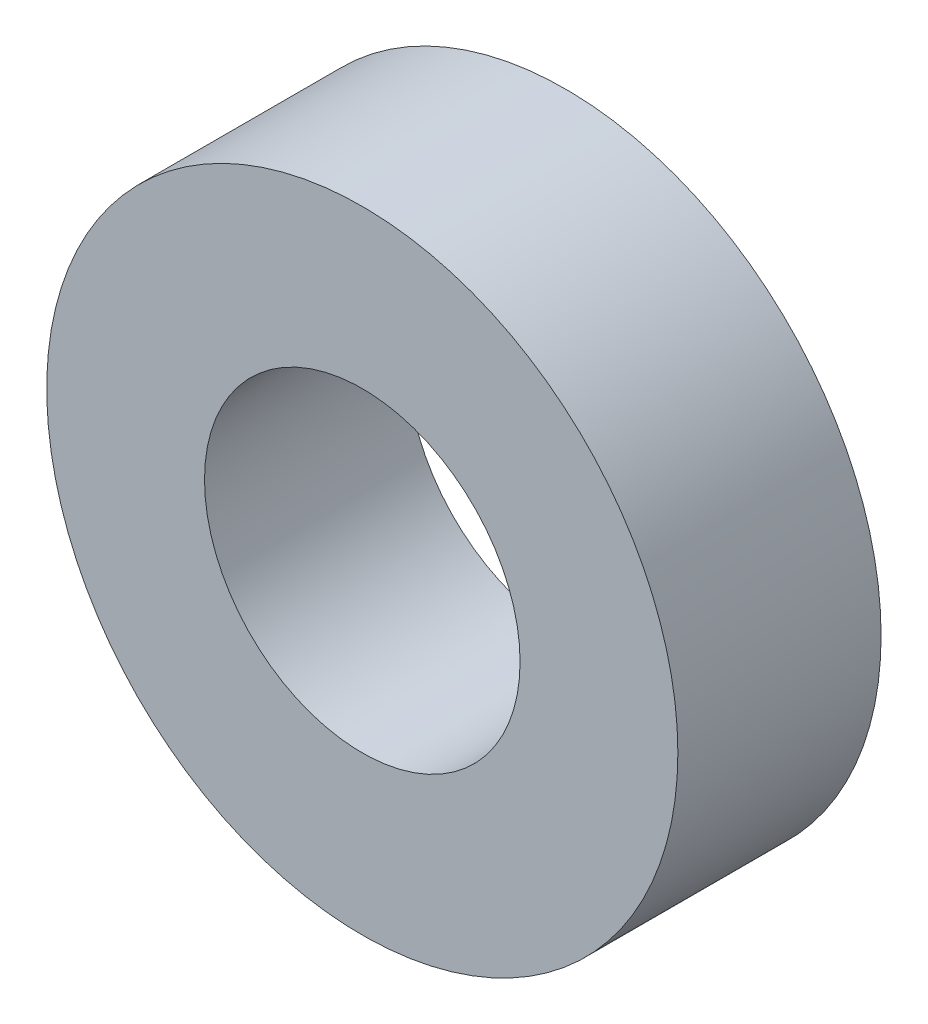
ISO-10303-21;
HEADER;
FILE_DESCRIPTION(('STEP AP214'),'2;1');
FILE_NAME('part.step','',(''),(''),'','','');
FILE_SCHEMA(('AUTOMOTIVE_DESIGN { 1 0 10303 214 1 1 1 1 }'));
ENDSEC;
DATA;
#1=APPLICATION_CONTEXT('core data for automotive mechanical design processes');
#2=APPLICATION_PROTOCOL_DEFINITION('international standard','automotive_design',2000,#1);
#3=PRODUCT_CONTEXT('',#1,'mechanical');
#4=PRODUCT('Part','Part','',(#3));
#5=PRODUCT_RELATED_PRODUCT_CATEGORY('part','',(#4));
#6=PRODUCT_DEFINITION_FORMATION('','',#4);
#7=PRODUCT_DEFINITION_CONTEXT('part definition',#1,'design');
#8=PRODUCT_DEFINITION('design','',#6,#7);
#9=PRODUCT_DEFINITION_SHAPE('','',#8);
#10=(LENGTH_UNIT() NAMED_UNIT(*) SI_UNIT(.MILLI.,.METRE.));
#11=(NAMED_UNIT(*) PLANE_ANGLE_UNIT() SI_UNIT($,.RADIAN.));
#12=(NAMED_UNIT(*) SI_UNIT($,.STERADIAN.) SOLID_ANGLE_UNIT());
#13=UNCERTAINTY_MEASURE_WITH_UNIT(LENGTH_MEASURE(1.E-05),#10,'distance_accuracy_value','');
#14=(GEOMETRIC_REPRESENTATION_CONTEXT(3) GLOBAL_UNCERTAINTY_ASSIGNED_CONTEXT((#13)) GLOBAL_UNIT_ASSIGNED_CONTEXT((#10,
#11,#12)) REPRESENTATION_CONTEXT('',''));
#15=CARTESIAN_POINT('',(0.,0.,0.));
#16=DIRECTION('',(0.,0.,1.));
#17=DIRECTION('',(1.,0.,0.));
#18=AXIS2_PLACEMENT_3D('',#15,#16,#17);
#19=CARTESIAN_POINT('',(0.,0.,6.13400094));
#20=DIRECTION('',(0.,0.,1.));
#21=DIRECTION('',(1.,0.,0.));
#22=AXIS2_PLACEMENT_3D('',#19,#20,#21);
#23=PLANE('',#22);
#24=CARTESIAN_POINT('',(0.,0.,6.13400094));
#25=DIRECTION('',(0.,0.,1.));
#26=DIRECTION('',(1.,0.,0.));
#27=AXIS2_PLACEMENT_3D('',#24,#25,#26);
#28=CIRCLE('',#27,9.525);
#29=CARTESIAN_POINT('',(9.525,0.,6.13400094));
#30=VERTEX_POINT('',#29);
#31=EDGE_CURVE('E10',#30,#30,#28,.T.);
#32=ORIENTED_EDGE('',*,*,#31,.T.);
#33=EDGE_LOOP('',(#32));
#34=FACE_BOUND('',#33,.T.);
#35=CARTESIAN_POINT('',(0.,0.,6.13400094));
#36=DIRECTION('',(0.,0.,1.));
#37=DIRECTION('',(1.,0.,0.));
#38=AXIS2_PLACEMENT_3D('',#35,#36,#37);
#39=CIRCLE('',#38,4.7625);
#40=CARTESIAN_POINT('',(4.7625,0.,6.13400094));
#41=VERTEX_POINT('',#40);
#42=EDGE_CURVE('E41',#41,#41,#39,.T.);
#43=ORIENTED_EDGE('',*,*,#42,.F.);
#44=EDGE_LOOP('',(#43));
#45=FACE_BOUND('',#44,.T.);
#46=ADVANCED_FACE('F30',(#34,#45),#23,.T.);
#47=CARTESIAN_POINT('',(0.,0.,0.));
#48=DIRECTION('',(0.,0.,1.));
#49=DIRECTION('',(1.,0.,0.));
#50=AXIS2_PLACEMENT_3D('',#47,#48,#49);
#51=PLANE('',#50);
#52=CARTESIAN_POINT('',(0.,0.,0.));
#53=DIRECTION('',(0.,0.,1.));
#54=DIRECTION('',(1.,0.,0.));
#55=AXIS2_PLACEMENT_3D('',#52,#53,#54);
#56=CIRCLE('',#55,9.525);
#57=CARTESIAN_POINT('',(9.525,0.,0.));
#58=VERTEX_POINT('',#57);
#59=EDGE_CURVE('E34',#58,#58,#56,.T.);
#60=ORIENTED_EDGE('',*,*,#59,.F.);
#61=EDGE_LOOP('',(#60));
#62=FACE_BOUND('',#61,.T.);
#63=CARTESIAN_POINT('',(0.,0.,0.));
#64=DIRECTION('',(0.,0.,1.));
#65=DIRECTION('',(1.,0.,0.));
#66=AXIS2_PLACEMENT_3D('',#63,#64,#65);
#67=CIRCLE('',#66,4.7625);
#68=CARTESIAN_POINT('',(4.7625,0.,0.));
#69=VERTEX_POINT('',#68);
#70=EDGE_CURVE('E43',#69,#69,#67,.T.);
#71=ORIENTED_EDGE('',*,*,#70,.T.);
#72=EDGE_LOOP('',(#71));
#73=FACE_BOUND('',#72,.T.);
#74=ADVANCED_FACE('F53',(#62,#73),#51,.F.);
#75=CARTESIAN_POINT('',(0.,0.,6.13400094));
#76=DIRECTION('',(0.,0.,-1.));
#77=DIRECTION('',(-1.,0.,0.));
#78=AXIS2_PLACEMENT_3D('',#75,#76,#77);
#79=CYLINDRICAL_SURFACE('',#78,9.525);
#80=ORIENTED_EDGE('',*,*,#31,.F.);
#81=EDGE_LOOP('',(#80));
#82=FACE_BOUND('',#81,.T.);
#83=ORIENTED_EDGE('',*,*,#59,.T.);
#84=EDGE_LOOP('',(#83));
#85=FACE_BOUND('',#84,.T.);
#86=ADVANCED_FACE('F32',(#82,#85),#79,.T.);
#87=CARTESIAN_POINT('',(0.,0.,6.13400094));
#88=DIRECTION('',(0.,0.,-1.));
#89=DIRECTION('',(-1.,0.,0.));
#90=AXIS2_PLACEMENT_3D('',#87,#88,#89);
#91=CYLINDRICAL_SURFACE('',#90,4.7625);
#92=ORIENTED_EDGE('',*,*,#42,.T.);
#93=EDGE_LOOP('',(#92));
#94=FACE_BOUND('',#93,.T.);
#95=ORIENTED_EDGE('',*,*,#70,.F.);
#96=EDGE_LOOP('',(#95));
#97=FACE_BOUND('',#96,.T.);
#98=ADVANCED_FACE('F49',(#94,#97),#91,.F.);
#99=CLOSED_SHELL('',(#46,#74,#86,#98));
#100=MANIFOLD_SOLID_BREP('B2',#99);
#101=ADVANCED_BREP_SHAPE_REPRESENTATION('',(#18,#100),#14);
#102=SHAPE_DEFINITION_REPRESENTATION(#9,#101);
ENDSEC;
END-ISO-10303-21;
